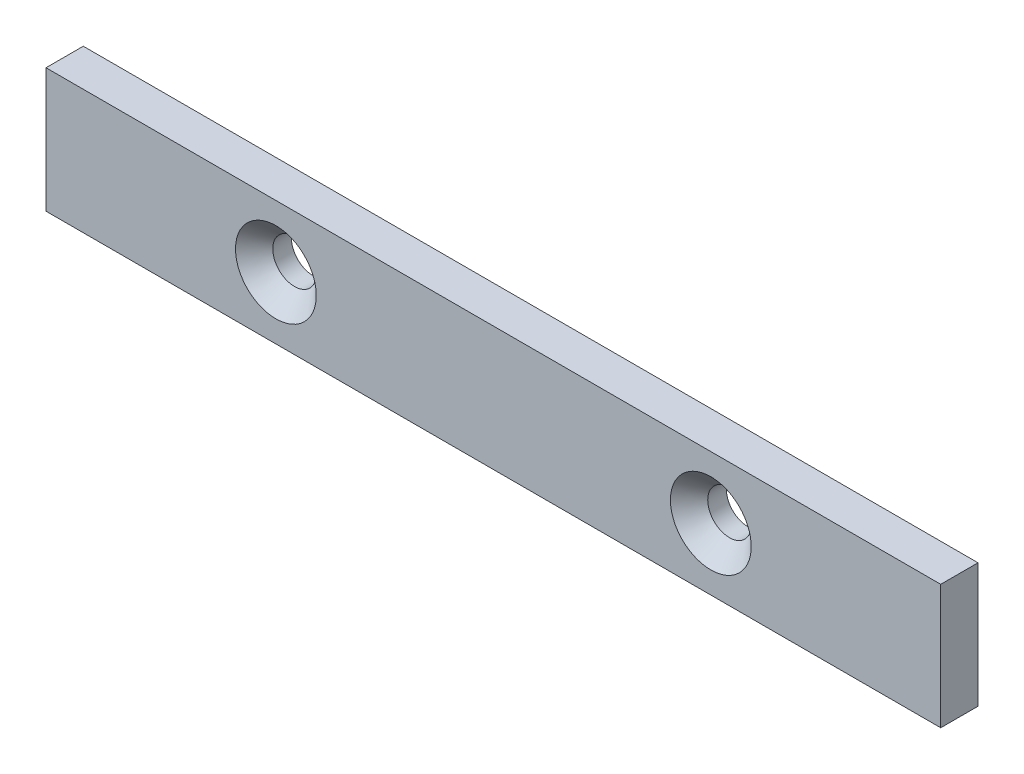
ISO-10303-21;
HEADER;
FILE_DESCRIPTION(('STEP AP214'),'2;1');
FILE_NAME('part.step','',(''),(''),'','','');
FILE_SCHEMA(('AUTOMOTIVE_DESIGN { 1 0 10303 214 1 1 1 1 }'));
ENDSEC;
DATA;
#1=APPLICATION_CONTEXT('core data for automotive mechanical design processes');
#2=APPLICATION_PROTOCOL_DEFINITION('international standard','automotive_design',2000,#1);
#3=PRODUCT_CONTEXT('',#1,'mechanical');
#4=PRODUCT('Part','Part','',(#3));
#5=PRODUCT_RELATED_PRODUCT_CATEGORY('part','',(#4));
#6=PRODUCT_DEFINITION_FORMATION('','',#4);
#7=PRODUCT_DEFINITION_CONTEXT('part definition',#1,'design');
#8=PRODUCT_DEFINITION('design','',#6,#7);
#9=PRODUCT_DEFINITION_SHAPE('','',#8);
#10=(LENGTH_UNIT() NAMED_UNIT(*) SI_UNIT(.MILLI.,.METRE.));
#11=(NAMED_UNIT(*) PLANE_ANGLE_UNIT() SI_UNIT($,.RADIAN.));
#12=(NAMED_UNIT(*) SI_UNIT($,.STERADIAN.) SOLID_ANGLE_UNIT());
#13=UNCERTAINTY_MEASURE_WITH_UNIT(LENGTH_MEASURE(1.E-05),#10,'distance_accuracy_value','');
#14=(GEOMETRIC_REPRESENTATION_CONTEXT(3) GLOBAL_UNCERTAINTY_ASSIGNED_CONTEXT((#13)) GLOBAL_UNIT_ASSIGNED_CONTEXT((#10,
#11,#12)) REPRESENTATION_CONTEXT('',''));
#15=CARTESIAN_POINT('',(0.,0.,0.));
#16=DIRECTION('',(0.,0.,1.));
#17=DIRECTION('',(1.,0.,0.));
#18=AXIS2_PLACEMENT_3D('',#15,#16,#17);
#19=CARTESIAN_POINT('',(0.,0.,3.));
#20=DIRECTION('',(0.,0.,-1.));
#21=DIRECTION('',(-1.,0.,0.));
#22=AXIS2_PLACEMENT_3D('',#19,#20,#21);
#23=PLANE('',#22);
#24=CARTESIAN_POINT('',(-35.,0.,3.));
#25=DIRECTION('',(0.,0.,-1.));
#26=DIRECTION('',(-1.,0.,0.));
#27=AXIS2_PLACEMENT_3D('',#24,#25,#26);
#28=CIRCLE('',#27,6.50000000000002);
#29=CARTESIAN_POINT('',(-41.5,0.,3.));
#30=VERTEX_POINT('',#29);
#31=EDGE_CURVE('E42',#30,#30,#28,.T.);
#32=ORIENTED_EDGE('',*,*,#31,.T.);
#33=EDGE_LOOP('',(#32));
#34=FACE_BOUND('',#33,.T.);
#35=CARTESIAN_POINT('',(35.,0.,3.));
#36=DIRECTION('',(0.,0.,-1.));
#37=DIRECTION('',(-1.,0.,0.));
#38=AXIS2_PLACEMENT_3D('',#35,#36,#37);
#39=CIRCLE('',#38,6.50000000000002);
#40=CARTESIAN_POINT('',(28.5,0.,3.));
#41=VERTEX_POINT('',#40);
#42=EDGE_CURVE('E113',#41,#41,#39,.T.);
#43=ORIENTED_EDGE('',*,*,#42,.T.);
#44=EDGE_LOOP('',(#43));
#45=FACE_BOUND('',#44,.T.);
#46=DIRECTION('',(0.,1.,0.));
#47=VECTOR('',#46,1.);
#48=CARTESIAN_POINT('',(72.,-10.,3.));
#49=LINE('',#48,#47);
#50=CARTESIAN_POINT('',(72.,-10.,3.));
#51=VERTEX_POINT('',#50);
#52=CARTESIAN_POINT('',(72.,10.,3.));
#53=VERTEX_POINT('',#52);
#54=EDGE_CURVE('E85',#51,#53,#49,.T.);
#55=ORIENTED_EDGE('',*,*,#54,.T.);
#56=DIRECTION('',(-1.,0.,0.));
#57=VECTOR('',#56,1.);
#58=CARTESIAN_POINT('',(-72.,10.,3.));
#59=LINE('',#58,#57);
#60=CARTESIAN_POINT('',(-72.,10.,3.));
#61=VERTEX_POINT('',#60);
#62=EDGE_CURVE('E81',#53,#61,#59,.T.);
#63=ORIENTED_EDGE('',*,*,#62,.T.);
#64=DIRECTION('',(0.,-1.,0.));
#65=VECTOR('',#64,1.);
#66=CARTESIAN_POINT('',(-72.,-10.,3.));
#67=LINE('',#66,#65);
#68=CARTESIAN_POINT('',(-72.,-10.,3.));
#69=VERTEX_POINT('',#68);
#70=EDGE_CURVE('E83',#61,#69,#67,.T.);
#71=ORIENTED_EDGE('',*,*,#70,.T.);
#72=DIRECTION('',(1.,0.,0.));
#73=VECTOR('',#72,1.);
#74=CARTESIAN_POINT('',(-72.,-10.,3.));
#75=LINE('',#74,#73);
#76=EDGE_CURVE('E50',#69,#51,#75,.T.);
#77=ORIENTED_EDGE('',*,*,#76,.T.);
#78=EDGE_LOOP('',(#55,#63,#71,#77));
#79=FACE_BOUND('',#78,.T.);
#80=ADVANCED_FACE('F33',(#34,#45,#79),#23,.F.);
#81=CARTESIAN_POINT('',(0.,0.,-3.));
#82=DIRECTION('',(0.,0.,-1.));
#83=DIRECTION('',(-1.,0.,0.));
#84=AXIS2_PLACEMENT_3D('',#81,#82,#83);
#85=PLANE('',#84);
#86=CARTESIAN_POINT('',(35.,0.,-3.));
#87=DIRECTION('',(0.,0.,1.));
#88=DIRECTION('',(1.,0.,0.));
#89=AXIS2_PLACEMENT_3D('',#86,#87,#88);
#90=CIRCLE('',#89,3.5);
#91=CARTESIAN_POINT('',(38.5,0.,-3.));
#92=VERTEX_POINT('',#91);
#93=EDGE_CURVE('E103',#92,#92,#90,.T.);
#94=ORIENTED_EDGE('',*,*,#93,.T.);
#95=EDGE_LOOP('',(#94));
#96=FACE_BOUND('',#95,.T.);
#97=DIRECTION('',(0.,1.,0.));
#98=VECTOR('',#97,1.);
#99=CARTESIAN_POINT('',(72.,-10.,-3.));
#100=LINE('',#99,#98);
#101=CARTESIAN_POINT('',(72.,-10.,-3.));
#102=VERTEX_POINT('',#101);
#103=CARTESIAN_POINT('',(72.,10.,-3.));
#104=VERTEX_POINT('',#103);
#105=EDGE_CURVE('E100',#102,#104,#100,.T.);
#106=ORIENTED_EDGE('',*,*,#105,.F.);
#107=DIRECTION('',(1.,0.,0.));
#108=VECTOR('',#107,1.);
#109=CARTESIAN_POINT('',(-72.,-10.,-3.));
#110=LINE('',#109,#108);
#111=CARTESIAN_POINT('',(-72.,-10.,-3.));
#112=VERTEX_POINT('',#111);
#113=EDGE_CURVE('E73',#112,#102,#110,.T.);
#114=ORIENTED_EDGE('',*,*,#113,.F.);
#115=DIRECTION('',(0.,-1.,0.));
#116=VECTOR('',#115,1.);
#117=CARTESIAN_POINT('',(-72.,-10.,-3.));
#118=LINE('',#117,#116);
#119=CARTESIAN_POINT('',(-72.,10.,-3.));
#120=VERTEX_POINT('',#119);
#121=EDGE_CURVE('E67',#120,#112,#118,.T.);
#122=ORIENTED_EDGE('',*,*,#121,.F.);
#123=DIRECTION('',(-1.,0.,0.));
#124=VECTOR('',#123,1.);
#125=CARTESIAN_POINT('',(-72.,10.,-3.));
#126=LINE('',#125,#124);
#127=EDGE_CURVE('E90',#104,#120,#126,.T.);
#128=ORIENTED_EDGE('',*,*,#127,.F.);
#129=EDGE_LOOP('',(#106,#114,#122,#128));
#130=FACE_BOUND('',#129,.T.);
#131=CARTESIAN_POINT('',(-35.,0.,-3.));
#132=DIRECTION('',(0.,0.,1.));
#133=DIRECTION('',(1.,0.,0.));
#134=AXIS2_PLACEMENT_3D('',#131,#132,#133);
#135=CIRCLE('',#134,3.5);
#136=CARTESIAN_POINT('',(-31.5,0.,-3.));
#137=VERTEX_POINT('',#136);
#138=EDGE_CURVE('E132',#137,#137,#135,.T.);
#139=ORIENTED_EDGE('',*,*,#138,.T.);
#140=EDGE_LOOP('',(#139));
#141=FACE_BOUND('',#140,.T.);
#142=ADVANCED_FACE('F139',(#96,#130,#141),#85,.T.);
#143=CARTESIAN_POINT('',(72.,-10.,3.));
#144=DIRECTION('',(-1.,0.,0.));
#145=DIRECTION('',(0.,0.,1.));
#146=AXIS2_PLACEMENT_3D('',#143,#144,#145);
#147=PLANE('',#146);
#148=ORIENTED_EDGE('',*,*,#105,.T.);
#149=DIRECTION('',(0.,0.,-1.));
#150=VECTOR('',#149,1.);
#151=CARTESIAN_POINT('',(72.,10.,3.));
#152=LINE('',#151,#150);
#153=EDGE_CURVE('E91',#53,#104,#152,.T.);
#154=ORIENTED_EDGE('',*,*,#153,.F.);
#155=ORIENTED_EDGE('',*,*,#54,.F.);
#156=DIRECTION('',(0.,0.,-1.));
#157=VECTOR('',#156,1.);
#158=CARTESIAN_POINT('',(72.,-10.,3.));
#159=LINE('',#158,#157);
#160=EDGE_CURVE('E96',#51,#102,#159,.T.);
#161=ORIENTED_EDGE('',*,*,#160,.T.);
#162=EDGE_LOOP('',(#148,#154,#155,#161));
#163=FACE_BOUND('',#162,.T.);
#164=ADVANCED_FACE('F155',(#163),#147,.F.);
#165=CARTESIAN_POINT('',(-72.,10.,3.));
#166=DIRECTION('',(0.,-1.,0.));
#167=DIRECTION('',(0.,0.,-1.));
#168=AXIS2_PLACEMENT_3D('',#165,#166,#167);
#169=PLANE('',#168);
#170=ORIENTED_EDGE('',*,*,#127,.T.);
#171=DIRECTION('',(0.,0.,-1.));
#172=VECTOR('',#171,1.);
#173=CARTESIAN_POINT('',(-72.,10.,3.));
#174=LINE('',#173,#172);
#175=EDGE_CURVE('E88',#61,#120,#174,.T.);
#176=ORIENTED_EDGE('',*,*,#175,.F.);
#177=ORIENTED_EDGE('',*,*,#62,.F.);
#178=ORIENTED_EDGE('',*,*,#153,.T.);
#179=EDGE_LOOP('',(#170,#176,#177,#178));
#180=FACE_BOUND('',#179,.T.);
#181=ADVANCED_FACE('F89',(#180),#169,.F.);
#182=CARTESIAN_POINT('',(-72.,-10.,3.));
#183=DIRECTION('',(1.,0.,0.));
#184=DIRECTION('',(0.,0.,-1.));
#185=AXIS2_PLACEMENT_3D('',#182,#183,#184);
#186=PLANE('',#185);
#187=ORIENTED_EDGE('',*,*,#121,.T.);
#188=DIRECTION('',(0.,0.,-1.));
#189=VECTOR('',#188,1.);
#190=CARTESIAN_POINT('',(-72.,-10.,3.));
#191=LINE('',#190,#189);
#192=EDGE_CURVE('E92',#69,#112,#191,.T.);
#193=ORIENTED_EDGE('',*,*,#192,.F.);
#194=ORIENTED_EDGE('',*,*,#70,.F.);
#195=ORIENTED_EDGE('',*,*,#175,.T.);
#196=EDGE_LOOP('',(#187,#193,#194,#195));
#197=FACE_BOUND('',#196,.T.);
#198=ADVANCED_FACE('F94',(#197),#186,.F.);
#199=CARTESIAN_POINT('',(-72.,-10.,3.));
#200=DIRECTION('',(0.,1.,0.));
#201=DIRECTION('',(0.,0.,1.));
#202=AXIS2_PLACEMENT_3D('',#199,#200,#201);
#203=PLANE('',#202);
#204=ORIENTED_EDGE('',*,*,#113,.T.);
#205=ORIENTED_EDGE('',*,*,#160,.F.);
#206=ORIENTED_EDGE('',*,*,#76,.F.);
#207=ORIENTED_EDGE('',*,*,#192,.T.);
#208=EDGE_LOOP('',(#204,#205,#206,#207));
#209=FACE_BOUND('',#208,.T.);
#210=ADVANCED_FACE('F143',(#209),#203,.F.);
#211=CARTESIAN_POINT('',(35.,0.,3.));
#212=DIRECTION('',(0.,0.,-1.));
#213=DIRECTION('',(-1.,0.,0.));
#214=AXIS2_PLACEMENT_3D('',#211,#212,#213);
#215=CYLINDRICAL_SURFACE('',#214,3.5);
#216=CARTESIAN_POINT('',(35.,0.,0.));
#217=DIRECTION('',(0.,0.,-1.));
#218=DIRECTION('',(-1.,0.,0.));
#219=AXIS2_PLACEMENT_3D('',#216,#217,#218);
#220=CIRCLE('',#219,3.5);
#221=CARTESIAN_POINT('',(31.5,0.,0.));
#222=VERTEX_POINT('',#221);
#223=EDGE_CURVE('E11',#222,#222,#220,.F.);
#224=ORIENTED_EDGE('',*,*,#223,.T.);
#225=EDGE_LOOP('',(#224));
#226=FACE_BOUND('',#225,.T.);
#227=ORIENTED_EDGE('',*,*,#93,.F.);
#228=EDGE_LOOP('',(#227));
#229=FACE_BOUND('',#228,.T.);
#230=ADVANCED_FACE('F128',(#226,#229),#215,.F.);
#231=CARTESIAN_POINT('',(-35.,0.,3.));
#232=DIRECTION('',(0.,0.,-1.));
#233=DIRECTION('',(-1.,0.,0.));
#234=AXIS2_PLACEMENT_3D('',#231,#232,#233);
#235=CYLINDRICAL_SURFACE('',#234,3.5);
#236=CARTESIAN_POINT('',(-35.,0.,0.));
#237=DIRECTION('',(0.,0.,-1.));
#238=DIRECTION('',(-1.,0.,0.));
#239=AXIS2_PLACEMENT_3D('',#236,#237,#238);
#240=CIRCLE('',#239,3.5);
#241=CARTESIAN_POINT('',(-38.5,0.,0.));
#242=VERTEX_POINT('',#241);
#243=EDGE_CURVE('E110',#242,#242,#240,.F.);
#244=ORIENTED_EDGE('',*,*,#243,.T.);
#245=EDGE_LOOP('',(#244));
#246=FACE_BOUND('',#245,.T.);
#247=ORIENTED_EDGE('',*,*,#138,.F.);
#248=EDGE_LOOP('',(#247));
#249=FACE_BOUND('',#248,.T.);
#250=ADVANCED_FACE('F123',(#246,#249),#235,.F.);
#251=CARTESIAN_POINT('',(-35.,0.,0.));
#252=DIRECTION('',(0.,0.,1.));
#253=DIRECTION('',(1.,0.,0.));
#254=AXIS2_PLACEMENT_3D('',#251,#252,#253);
#255=CONICAL_SURFACE('',#254,3.5,0.785398163397449);
#256=ORIENTED_EDGE('',*,*,#31,.F.);
#257=EDGE_LOOP('',(#256));
#258=FACE_BOUND('',#257,.T.);
#259=ORIENTED_EDGE('',*,*,#243,.F.);
#260=EDGE_LOOP('',(#259));
#261=FACE_BOUND('',#260,.T.);
#262=ADVANCED_FACE('F120',(#258,#261),#255,.F.);
#263=CARTESIAN_POINT('',(35.,0.,0.));
#264=DIRECTION('',(0.,0.,1.));
#265=DIRECTION('',(1.,0.,0.));
#266=AXIS2_PLACEMENT_3D('',#263,#264,#265);
#267=CONICAL_SURFACE('',#266,3.5,0.785398163397448);
#268=ORIENTED_EDGE('',*,*,#42,.F.);
#269=EDGE_LOOP('',(#268));
#270=FACE_BOUND('',#269,.T.);
#271=ORIENTED_EDGE('',*,*,#223,.F.);
#272=EDGE_LOOP('',(#271));
#273=FACE_BOUND('',#272,.T.);
#274=ADVANCED_FACE('F35',(#270,#273),#267,.F.);
#275=CLOSED_SHELL('',(#80,#142,#164,#181,#198,#210,#230,#250,#262,#274));
#276=MANIFOLD_SOLID_BREP('B2',#275);
#277=ADVANCED_BREP_SHAPE_REPRESENTATION('',(#18,#276),#14);
#278=SHAPE_DEFINITION_REPRESENTATION(#9,#277);
ENDSEC;
END-ISO-10303-21;
